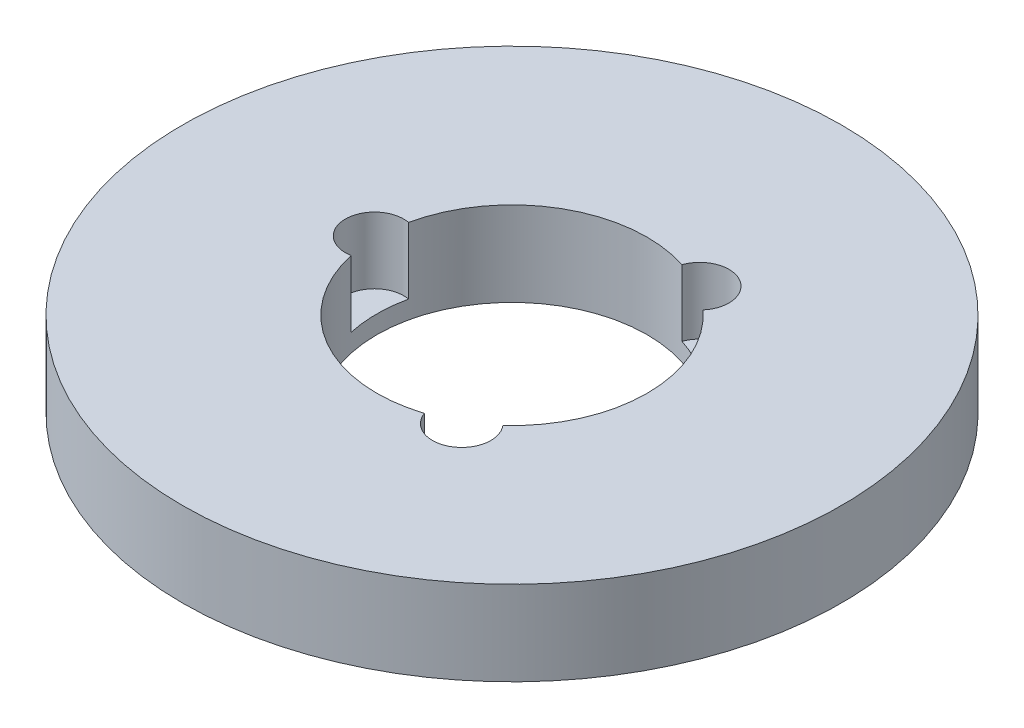
ISO-10303-21;
HEADER;
FILE_DESCRIPTION(('STEP AP214'),'2;1');
FILE_NAME('part.step','',(''),(''),'','','');
FILE_SCHEMA(('AUTOMOTIVE_DESIGN { 1 0 10303 214 1 1 1 1 }'));
ENDSEC;
DATA;
#1=APPLICATION_CONTEXT('core data for automotive mechanical design processes');
#2=APPLICATION_PROTOCOL_DEFINITION('international standard','automotive_design',2000,#1);
#3=PRODUCT_CONTEXT('',#1,'mechanical');
#4=PRODUCT('Part','Part','',(#3));
#5=PRODUCT_RELATED_PRODUCT_CATEGORY('part','',(#4));
#6=PRODUCT_DEFINITION_FORMATION('','',#4);
#7=PRODUCT_DEFINITION_CONTEXT('part definition',#1,'design');
#8=PRODUCT_DEFINITION('design','',#6,#7);
#9=PRODUCT_DEFINITION_SHAPE('','',#8);
#10=(LENGTH_UNIT() NAMED_UNIT(*) SI_UNIT(.MILLI.,.METRE.));
#11=(NAMED_UNIT(*) PLANE_ANGLE_UNIT() SI_UNIT($,.RADIAN.));
#12=(NAMED_UNIT(*) SI_UNIT($,.STERADIAN.) SOLID_ANGLE_UNIT());
#13=UNCERTAINTY_MEASURE_WITH_UNIT(LENGTH_MEASURE(1.E-05),#10,'distance_accuracy_value','');
#14=(GEOMETRIC_REPRESENTATION_CONTEXT(3) GLOBAL_UNCERTAINTY_ASSIGNED_CONTEXT((#13)) GLOBAL_UNIT_ASSIGNED_CONTEXT((#10,
#11,#12)) REPRESENTATION_CONTEXT('',''));
#15=CARTESIAN_POINT('',(0.,0.,0.));
#16=DIRECTION('',(0.,0.,1.));
#17=DIRECTION('',(1.,0.,0.));
#18=AXIS2_PLACEMENT_3D('',#15,#16,#17);
#19=CARTESIAN_POINT('',(0.,25.,0.));
#20=DIRECTION('',(0.,-1.,0.));
#21=DIRECTION('',(0.,0.,-1.));
#22=AXIS2_PLACEMENT_3D('',#19,#20,#21);
#23=CYLINDRICAL_SURFACE('',#22,97.5);
#24=CARTESIAN_POINT('',(0.,25.,0.));
#25=DIRECTION('',(0.,1.,0.));
#26=DIRECTION('',(0.,0.,1.));
#27=AXIS2_PLACEMENT_3D('',#24,#25,#26);
#28=CIRCLE('',#27,97.5);
#29=CARTESIAN_POINT('',(0.,25.,97.5));
#30=VERTEX_POINT('',#29);
#31=EDGE_CURVE('E126',#30,#30,#28,.T.);
#32=ORIENTED_EDGE('',*,*,#31,.F.);
#33=EDGE_LOOP('',(#32));
#34=FACE_BOUND('',#33,.T.);
#35=CARTESIAN_POINT('',(0.,0.,0.));
#36=DIRECTION('',(0.,1.,0.));
#37=DIRECTION('',(0.,0.,1.));
#38=AXIS2_PLACEMENT_3D('',#35,#36,#37);
#39=CIRCLE('',#38,97.5);
#40=CARTESIAN_POINT('',(0.,0.,97.5));
#41=VERTEX_POINT('',#40);
#42=EDGE_CURVE('E124',#41,#41,#39,.T.);
#43=ORIENTED_EDGE('',*,*,#42,.T.);
#44=EDGE_LOOP('',(#43));
#45=FACE_BOUND('',#44,.T.);
#46=ADVANCED_FACE('F39',(#34,#45),#23,.T.);
#47=CARTESIAN_POINT('',(0.,25.,0.));
#48=DIRECTION('',(0.,1.,0.));
#49=DIRECTION('',(0.,0.,1.));
#50=AXIS2_PLACEMENT_3D('',#47,#48,#49);
#51=PLANE('',#50);
#52=CARTESIAN_POINT('',(20.3336772814242,25.,35.2189621561353));
#53=DIRECTION('',(0.,1.,0.));
#54=DIRECTION('',(0.866025403784436,0.,-0.500000000000004));
#55=AXIS2_PLACEMENT_3D('',#52,#53,#54);
#56=CIRCLE('',#55,8.63637742495066);
#57=CARTESIAN_POINT('',(12.1909524107686,25.,38.0969904233704));
#58=VERTEX_POINT('',#57);
#59=CARTESIAN_POINT('',(26.8974853089872,25.,29.6061696957377));
#60=VERTEX_POINT('',#59);
#61=EDGE_CURVE('E147',#58,#60,#56,.T.);
#62=ORIENTED_EDGE('',*,*,#61,.F.);
#63=CARTESIAN_POINT('',(0.,25.,0.));
#64=DIRECTION('',(0.,1.,0.));
#65=DIRECTION('',(0.,0.,1.));
#66=AXIS2_PLACEMENT_3D('',#63,#64,#65);
#67=CIRCLE('',#66,40.);
#68=CARTESIAN_POINT('',(-39.0884377197555,25.,8.49082072763263));
#69=VERTEX_POINT('',#68);
#70=EDGE_CURVE('E118',#69,#58,#67,.T.);
#71=ORIENTED_EDGE('',*,*,#70,.F.);
#72=CARTESIAN_POINT('',(-40.6673545628481,25.,0.));
#73=DIRECTION('',(0.,1.,0.));
#74=DIRECTION('',(0.,0.,1.));
#75=AXIS2_PLACEMENT_3D('',#72,#73,#74);
#76=CIRCLE('',#75,8.63637742495066);
#77=CARTESIAN_POINT('',(-39.0884377197555,25.,-8.49082072763263));
#78=VERTEX_POINT('',#77);
#79=EDGE_CURVE('E113',#78,#69,#76,.T.);
#80=ORIENTED_EDGE('',*,*,#79,.F.);
#81=CARTESIAN_POINT('',(12.1909524107681,25.,-38.0969904233706));
#82=VERTEX_POINT('',#81);
#83=EDGE_CURVE('E106',#82,#78,#67,.T.);
#84=ORIENTED_EDGE('',*,*,#83,.F.);
#85=CARTESIAN_POINT('',(20.3336772814237,25.,-35.2189621561356));
#86=DIRECTION('',(0.,1.,0.));
#87=DIRECTION('',(-0.866025403784443,0.,-0.499999999999992));
#88=AXIS2_PLACEMENT_3D('',#85,#86,#87);
#89=CIRCLE('',#88,8.63637742495066);
#90=CARTESIAN_POINT('',(26.8974853089868,25.,-29.6061696957381));
#91=VERTEX_POINT('',#90);
#92=EDGE_CURVE('E90',#91,#82,#89,.T.);
#93=ORIENTED_EDGE('',*,*,#92,.F.);
#94=EDGE_CURVE('E116',#60,#91,#67,.T.);
#95=ORIENTED_EDGE('',*,*,#94,.F.);
#96=EDGE_LOOP('',(#62,#71,#80,#84,#93,#95));
#97=FACE_BOUND('',#96,.T.);
#98=ORIENTED_EDGE('',*,*,#31,.T.);
#99=EDGE_LOOP('',(#98));
#100=FACE_BOUND('',#99,.T.);
#101=ADVANCED_FACE('F115',(#97,#100),#51,.T.);
#102=CARTESIAN_POINT('',(0.,0.,0.));
#103=DIRECTION('',(0.,1.,0.));
#104=DIRECTION('',(0.,0.,1.));
#105=AXIS2_PLACEMENT_3D('',#102,#103,#104);
#106=PLANE('',#105);
#107=CARTESIAN_POINT('',(0.,0.,0.));
#108=DIRECTION('',(0.,1.,0.));
#109=DIRECTION('',(0.,0.,1.));
#110=AXIS2_PLACEMENT_3D('',#107,#108,#109);
#111=CIRCLE('',#110,40.);
#112=CARTESIAN_POINT('',(0.,0.,40.));
#113=VERTEX_POINT('',#112);
#114=EDGE_CURVE('E120',#113,#113,#111,.T.);
#115=ORIENTED_EDGE('',*,*,#114,.T.);
#116=EDGE_LOOP('',(#115));
#117=FACE_BOUND('',#116,.T.);
#118=ORIENTED_EDGE('',*,*,#42,.F.);
#119=EDGE_LOOP('',(#118));
#120=FACE_BOUND('',#119,.T.);
#121=ADVANCED_FACE('F164',(#117,#120),#106,.F.);
#122=CARTESIAN_POINT('',(0.,25.,0.));
#123=DIRECTION('',(0.,-1.,0.));
#124=DIRECTION('',(0.,0.,-1.));
#125=AXIS2_PLACEMENT_3D('',#122,#123,#124);
#126=CYLINDRICAL_SURFACE('',#125,40.);
#127=DIRECTION('',(0.,1.,0.));
#128=VECTOR('',#127,1.);
#129=CARTESIAN_POINT('',(12.1909524107686,15.1715413496904,38.0969904233704));
#130=LINE('',#129,#128);
#131=CARTESIAN_POINT('',(12.1909524107686,5.3430826993807,38.0969904233704));
#132=VERTEX_POINT('',#131);
#133=EDGE_CURVE('E11',#132,#58,#130,.T.);
#134=ORIENTED_EDGE('',*,*,#133,.F.);
#135=CARTESIAN_POINT('',(0.,5.3430826993807,0.));
#136=DIRECTION('',(0.,1.,0.));
#137=DIRECTION('',(0.,0.,1.));
#138=AXIS2_PLACEMENT_3D('',#135,#136,#137);
#139=CIRCLE('',#138,40.);
#140=CARTESIAN_POINT('',(26.8974853089872,5.3430826993807,29.6061696957377));
#141=VERTEX_POINT('',#140);
#142=EDGE_CURVE('E144',#132,#141,#139,.T.);
#143=ORIENTED_EDGE('',*,*,#142,.T.);
#144=DIRECTION('',(0.,1.,0.));
#145=VECTOR('',#144,1.);
#146=CARTESIAN_POINT('',(26.8974853089872,15.1715413496904,29.6061696957377));
#147=LINE('',#146,#145);
#148=EDGE_CURVE('E46',#60,#141,#147,.F.);
#149=ORIENTED_EDGE('',*,*,#148,.F.);
#150=ORIENTED_EDGE('',*,*,#94,.T.);
#151=DIRECTION('',(0.,1.,0.));
#152=VECTOR('',#151,1.);
#153=CARTESIAN_POINT('',(26.8974853089868,15.1715413496904,-29.6061696957381));
#154=LINE('',#153,#152);
#155=CARTESIAN_POINT('',(26.8974853089868,5.3430826993807,-29.6061696957381));
#156=VERTEX_POINT('',#155);
#157=EDGE_CURVE('E92',#156,#91,#154,.T.);
#158=ORIENTED_EDGE('',*,*,#157,.F.);
#159=CARTESIAN_POINT('',(0.,5.3430826993807,0.));
#160=DIRECTION('',(0.,1.,0.));
#161=DIRECTION('',(0.,0.,1.));
#162=AXIS2_PLACEMENT_3D('',#159,#160,#161);
#163=CIRCLE('',#162,40.);
#164=CARTESIAN_POINT('',(12.1909524107681,5.3430826993807,-38.0969904233706));
#165=VERTEX_POINT('',#164);
#166=EDGE_CURVE('E107',#156,#165,#163,.T.);
#167=ORIENTED_EDGE('',*,*,#166,.T.);
#168=DIRECTION('',(0.,1.,0.));
#169=VECTOR('',#168,1.);
#170=CARTESIAN_POINT('',(12.1909524107681,15.1715413496904,-38.0969904233706));
#171=LINE('',#170,#169);
#172=EDGE_CURVE('E95',#82,#165,#171,.F.);
#173=ORIENTED_EDGE('',*,*,#172,.F.);
#174=ORIENTED_EDGE('',*,*,#83,.T.);
#175=DIRECTION('',(0.,1.,0.));
#176=VECTOR('',#175,1.);
#177=CARTESIAN_POINT('',(-39.0884377197555,15.1715413496904,-8.49082072763263));
#178=LINE('',#177,#176);
#179=CARTESIAN_POINT('',(-39.0884377197555,5.3430826993807,-8.49082072763263));
#180=VERTEX_POINT('',#179);
#181=EDGE_CURVE('E143',#180,#78,#178,.T.);
#182=ORIENTED_EDGE('',*,*,#181,.F.);
#183=CARTESIAN_POINT('',(0.,5.3430826993807,0.));
#184=DIRECTION('',(0.,1.,0.));
#185=DIRECTION('',(0.,0.,1.));
#186=AXIS2_PLACEMENT_3D('',#183,#184,#185);
#187=CIRCLE('',#186,40.);
#188=CARTESIAN_POINT('',(-39.0884377197555,5.3430826993807,8.49082072763263));
#189=VERTEX_POINT('',#188);
#190=EDGE_CURVE('E132',#180,#189,#187,.T.);
#191=ORIENTED_EDGE('',*,*,#190,.T.);
#192=DIRECTION('',(0.,1.,0.));
#193=VECTOR('',#192,1.);
#194=CARTESIAN_POINT('',(-39.0884377197555,15.1715413496904,8.49082072763263));
#195=LINE('',#194,#193);
#196=EDGE_CURVE('E137',#69,#189,#195,.F.);
#197=ORIENTED_EDGE('',*,*,#196,.F.);
#198=ORIENTED_EDGE('',*,*,#70,.T.);
#199=EDGE_LOOP('',(#134,#143,#149,#150,#158,#167,#173,#174,#182,#191,#197,#198));
#200=FACE_BOUND('',#199,.T.);
#201=ORIENTED_EDGE('',*,*,#114,.F.);
#202=EDGE_LOOP('',(#201));
#203=FACE_BOUND('',#202,.T.);
#204=ADVANCED_FACE('F103',(#200,#203),#126,.F.);
#205=CARTESIAN_POINT('',(-40.6673545628481,5.3430826993807,0.));
#206=DIRECTION('',(0.,1.,0.));
#207=DIRECTION('',(0.,0.,1.));
#208=AXIS2_PLACEMENT_3D('',#205,#206,#207);
#209=CYLINDRICAL_SURFACE('',#208,8.63637742495066);
#210=ORIENTED_EDGE('',*,*,#181,.T.);
#211=ORIENTED_EDGE('',*,*,#79,.T.);
#212=ORIENTED_EDGE('',*,*,#196,.T.);
#213=CARTESIAN_POINT('',(-40.6673545628481,5.3430826993807,0.));
#214=DIRECTION('',(0.,1.,0.));
#215=DIRECTION('',(0.,0.,1.));
#216=AXIS2_PLACEMENT_3D('',#213,#214,#215);
#217=CIRCLE('',#216,8.63637742495066);
#218=EDGE_CURVE('E121',#180,#189,#217,.T.);
#219=ORIENTED_EDGE('',*,*,#218,.F.);
#220=EDGE_LOOP('',(#210,#211,#212,#219));
#221=FACE_BOUND('',#220,.T.);
#222=ADVANCED_FACE('F174',(#221),#209,.F.);
#223=CARTESIAN_POINT('',(-40.6673545628481,5.3430826993807,0.));
#224=DIRECTION('',(0.,1.,0.));
#225=DIRECTION('',(0.,0.,1.));
#226=AXIS2_PLACEMENT_3D('',#223,#224,#225);
#227=PLANE('',#226);
#228=ORIENTED_EDGE('',*,*,#218,.T.);
#229=ORIENTED_EDGE('',*,*,#190,.F.);
#230=EDGE_LOOP('',(#228,#229));
#231=FACE_BOUND('',#230,.T.);
#232=ADVANCED_FACE('F177',(#231),#227,.T.);
#233=CARTESIAN_POINT('',(20.3336772814237,5.3430826993807,-35.2189621561356));
#234=DIRECTION('',(0.,1.,0.));
#235=DIRECTION('',(0.,0.,1.));
#236=AXIS2_PLACEMENT_3D('',#233,#234,#235);
#237=CYLINDRICAL_SURFACE('',#236,8.63637742495066);
#238=ORIENTED_EDGE('',*,*,#157,.T.);
#239=ORIENTED_EDGE('',*,*,#92,.T.);
#240=ORIENTED_EDGE('',*,*,#172,.T.);
#241=CARTESIAN_POINT('',(20.3336772814237,5.3430826993807,-35.2189621561356));
#242=DIRECTION('',(0.,1.,0.));
#243=DIRECTION('',(-0.866025403784443,0.,-0.499999999999992));
#244=AXIS2_PLACEMENT_3D('',#241,#242,#243);
#245=CIRCLE('',#244,8.63637742495066);
#246=EDGE_CURVE('E56',#156,#165,#245,.T.);
#247=ORIENTED_EDGE('',*,*,#246,.F.);
#248=EDGE_LOOP('',(#238,#239,#240,#247));
#249=FACE_BOUND('',#248,.T.);
#250=ADVANCED_FACE('F93',(#249),#237,.F.);
#251=CARTESIAN_POINT('',(20.3336772814237,5.3430826993807,-35.2189621561356));
#252=DIRECTION('',(0.,1.,0.));
#253=DIRECTION('',(-0.866025403784443,0.,-0.499999999999992));
#254=AXIS2_PLACEMENT_3D('',#251,#252,#253);
#255=PLANE('',#254);
#256=ORIENTED_EDGE('',*,*,#246,.T.);
#257=ORIENTED_EDGE('',*,*,#166,.F.);
#258=EDGE_LOOP('',(#256,#257));
#259=FACE_BOUND('',#258,.T.);
#260=ADVANCED_FACE('F160',(#259),#255,.T.);
#261=CARTESIAN_POINT('',(20.3336772814242,5.3430826993807,35.2189621561353));
#262=DIRECTION('',(0.,1.,0.));
#263=DIRECTION('',(0.,0.,1.));
#264=AXIS2_PLACEMENT_3D('',#261,#262,#263);
#265=CYLINDRICAL_SURFACE('',#264,8.63637742495066);
#266=ORIENTED_EDGE('',*,*,#133,.T.);
#267=ORIENTED_EDGE('',*,*,#61,.T.);
#268=ORIENTED_EDGE('',*,*,#148,.T.);
#269=CARTESIAN_POINT('',(20.3336772814242,5.3430826993807,35.2189621561353));
#270=DIRECTION('',(0.,1.,0.));
#271=DIRECTION('',(0.866025403784436,0.,-0.500000000000004));
#272=AXIS2_PLACEMENT_3D('',#269,#270,#271);
#273=CIRCLE('',#272,8.63637742495066);
#274=EDGE_CURVE('E55',#132,#141,#273,.T.);
#275=ORIENTED_EDGE('',*,*,#274,.F.);
#276=EDGE_LOOP('',(#266,#267,#268,#275));
#277=FACE_BOUND('',#276,.T.);
#278=ADVANCED_FACE('F149',(#277),#265,.F.);
#279=CARTESIAN_POINT('',(20.3336772814242,5.3430826993807,35.2189621561353));
#280=DIRECTION('',(0.,1.,0.));
#281=DIRECTION('',(0.866025403784436,0.,-0.500000000000004));
#282=AXIS2_PLACEMENT_3D('',#279,#280,#281);
#283=PLANE('',#282);
#284=ORIENTED_EDGE('',*,*,#274,.T.);
#285=ORIENTED_EDGE('',*,*,#142,.F.);
#286=EDGE_LOOP('',(#284,#285));
#287=FACE_BOUND('',#286,.T.);
#288=ADVANCED_FACE('F151',(#287),#283,.T.);
#289=CLOSED_SHELL('',(#46,#101,#121,#204,#222,#232,#250,#260,#278,#288));
#290=MANIFOLD_SOLID_BREP('B2',#289);
#291=ADVANCED_BREP_SHAPE_REPRESENTATION('',(#18,#290),#14);
#292=SHAPE_DEFINITION_REPRESENTATION(#9,#291);
ENDSEC;
END-ISO-10303-21;
